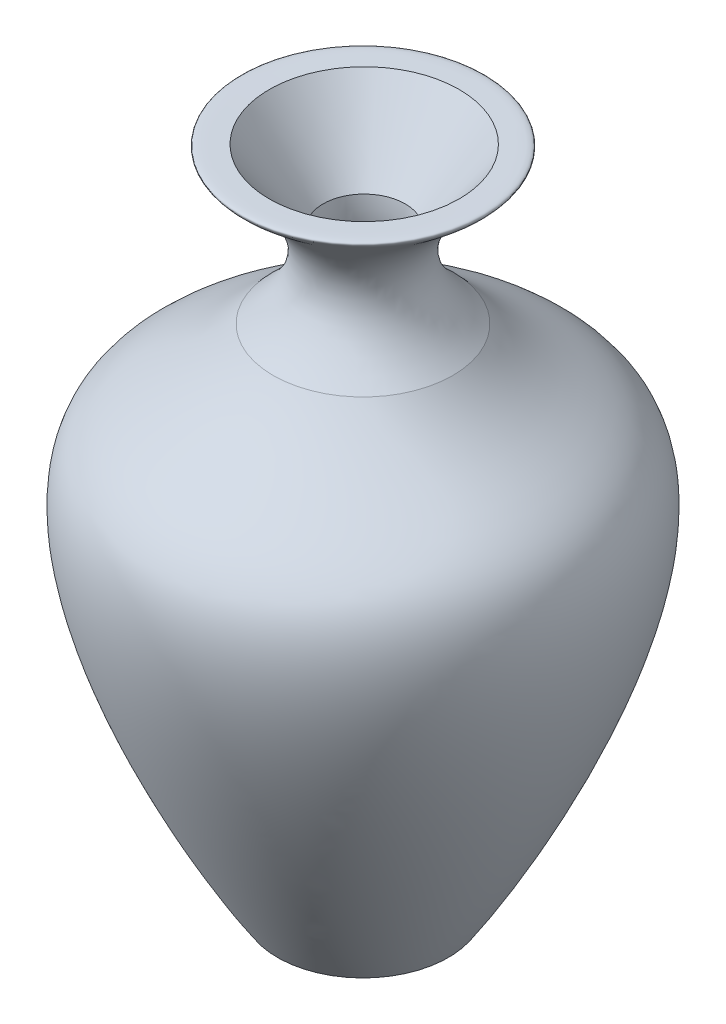
ISO-10303-21;
HEADER;
FILE_DESCRIPTION(('STEP AP214'),'2;1');
FILE_NAME('part.step','',(''),(''),'','','');
FILE_SCHEMA(('AUTOMOTIVE_DESIGN { 1 0 10303 214 1 1 1 1 }'));
ENDSEC;
DATA;
#1=APPLICATION_CONTEXT('core data for automotive mechanical design processes');
#2=APPLICATION_PROTOCOL_DEFINITION('international standard','automotive_design',2000,#1);
#3=PRODUCT_CONTEXT('',#1,'mechanical');
#4=PRODUCT('Part','Part','',(#3));
#5=PRODUCT_RELATED_PRODUCT_CATEGORY('part','',(#4));
#6=PRODUCT_DEFINITION_FORMATION('','',#4);
#7=PRODUCT_DEFINITION_CONTEXT('part definition',#1,'design');
#8=PRODUCT_DEFINITION('design','',#6,#7);
#9=PRODUCT_DEFINITION_SHAPE('','',#8);
#10=(LENGTH_UNIT() NAMED_UNIT(*) SI_UNIT(.MILLI.,.METRE.));
#11=(NAMED_UNIT(*) PLANE_ANGLE_UNIT() SI_UNIT($,.RADIAN.));
#12=(NAMED_UNIT(*) SI_UNIT($,.STERADIAN.) SOLID_ANGLE_UNIT());
#13=UNCERTAINTY_MEASURE_WITH_UNIT(LENGTH_MEASURE(1.E-05),#10,'distance_accuracy_value','');
#14=(GEOMETRIC_REPRESENTATION_CONTEXT(3) GLOBAL_UNCERTAINTY_ASSIGNED_CONTEXT((#13)) GLOBAL_UNIT_ASSIGNED_CONTEXT((#10,
#11,#12)) REPRESENTATION_CONTEXT('',''));
#15=CARTESIAN_POINT('',(0.,0.,0.));
#16=DIRECTION('',(0.,0.,1.));
#17=DIRECTION('',(1.,0.,0.));
#18=AXIS2_PLACEMENT_3D('',#15,#16,#17);
#19=CARTESIAN_POINT('',(-1.56203409294564,27.720427486685,0.));
#20=CARTESIAN_POINT('',(-5.38282688403167,31.0399201206818,0.));
#21=CARTESIAN_POINT('',(1.60950553415091,35.8701873183773,0.));
#22=CARTESIAN_POINT('',(-0.303241905816244,35.0337790173892,0.));
#23=CARTESIAN_POINT('',(-2.43505046655224,35.1344935713698,0.));
#24=B_SPLINE_CURVE_WITH_KNOTS('',3,(#19,#20,#21,#22,#23),.UNSPECIFIED.,.F.,.F.,(4,1,4),(0.,
0.485494703426431,1.),.UNSPECIFIED.);
#25=CARTESIAN_POINT('',(-5.81923390881345,35.1344935713698,0.));
#26=DIRECTION('',(0.,1.,0.));
#27=AXIS1_PLACEMENT('',#25,#26);
#28=SURFACE_OF_REVOLUTION('',#24,#27);
#29=CARTESIAN_POINT('',(-1.26087766802877,35.1223724372884,0.));
#30=CARTESIAN_POINT('',(-1.26087753263055,35.1223724373279,0.0443042542863991));
#31=CARTESIAN_POINT('',(-1.26153169142155,35.1223722686442,0.0886056860995091));
#32=CARTESIAN_POINT('',(-1.26546132133863,35.1223712553732,0.221610122033602));
#33=CARTESIAN_POINT('',(-1.2707083258953,35.1223699024367,0.310265079548945));
#34=CARTESIAN_POINT('',(-1.28644073732348,35.1223658470988,0.487170837582217));
#35=CARTESIAN_POINT('',(-1.2969304659894,35.1223631435841,0.575421243942078));
#36=CARTESIAN_POINT('',(-1.3286508122077,35.1223549720012,0.788285169210442));
#37=CARTESIAN_POINT('',(-1.35254681275785,35.1223488185444,0.912512117467511));
#38=CARTESIAN_POINT('',(-1.41071993989422,35.1223338535436,1.1585634240051));
#39=CARTESIAN_POINT('',(-1.44500210523993,35.1223250407094,1.28038658548562));
#40=CARTESIAN_POINT('',(-1.52375467443834,35.1223048226779,1.52088073057029));
#41=CARTESIAN_POINT('',(-1.56823886479373,35.1222934139728,1.63954720399103));
#42=CARTESIAN_POINT('',(-1.66707115135707,35.12226810803,1.87275069426012));
#43=CARTESIAN_POINT('',(-1.72142294769964,35.1222542098589,1.9872861426883));
#44=CARTESIAN_POINT('',(-1.8395291262891,35.1222240673695,2.21124627312288));
#45=CARTESIAN_POINT('',(-1.90327344544748,35.1222078255626,2.32067626189077));
#46=CARTESIAN_POINT('',(-2.03977948405078,35.1221731215421,2.53381657722726));
#47=CARTESIAN_POINT('',(-2.11254452375813,35.122154658511,2.63752477735675));
#48=CARTESIAN_POINT('',(-2.26649610854971,35.1221156935669,2.83836235999128));
#49=CARTESIAN_POINT('',(-2.34767610622586,35.1220951932396,2.93549676152007));
#50=CARTESIAN_POINT('',(-2.51795882830918,35.1220523116934,3.12261904623739));
#51=CARTESIAN_POINT('',(-2.6070644653195,35.1220299297833,3.21260427897817));
#52=CARTESIAN_POINT('',(-2.79252093636885,35.12198348855,3.38473155731859));
#53=CARTESIAN_POINT('',(-2.88887033171441,35.12195942956,3.46687515303981));
#54=CARTESIAN_POINT('',(-3.08818202181317,35.1219098254862,3.62278447111925));
#55=CARTESIAN_POINT('',(-3.19114674548377,35.1218842798569,3.6965470884368));
#56=CARTESIAN_POINT('',(-3.40289373137882,35.1218319326885,3.83511450206491));
#57=CARTESIAN_POINT('',(-3.51167427744369,35.1218051315203,3.89992192090286));
#58=CARTESIAN_POINT('',(-3.73434863575031,35.1217504778994,4.02016621686076));
#59=CARTESIAN_POINT('',(-3.84824432118027,35.1217226250623,4.07559962517227));
#60=CARTESIAN_POINT('',(-4.08025581408362,35.1216661153465,4.17665256488529));
#61=CARTESIAN_POINT('',(-4.19836994469058,35.1216374587883,4.22227594631855));
#62=CARTESIAN_POINT('',(-4.4380653505648,35.1215795495594,4.30342728861014));
#63=CARTESIAN_POINT('',(-4.55964788975697,35.1215502966725,4.33895151615494));
#64=CARTESIAN_POINT('',(-4.80532789436121,35.1214914453625,4.39961770569542));
#65=CARTESIAN_POINT('',(-4.92942439102247,35.1214618470742,4.4247635900372));
#66=CARTESIAN_POINT('',(-5.17933814996448,35.1214025106902,4.46452201133788));
#67=CARTESIAN_POINT('',(-5.30515603063426,35.1213727725468,4.47913065597159));
#68=CARTESIAN_POINT('',(-5.5575392124213,35.1213133980989,4.49768884368456));
#69=CARTESIAN_POINT('',(-5.68410423100856,35.1212837617617,4.50164218594701));
#70=CARTESIAN_POINT('',(-5.93713060561225,35.1212247947764,4.4988848259939));
#71=CARTESIAN_POINT('',(-6.06359190610376,35.1211954642452,4.49217018603161));
#72=CARTESIAN_POINT('',(-6.44137048209507,35.1211082701184,4.45604529001378));
#73=CARTESIAN_POINT('',(-6.69135697463565,35.1210511394012,4.41067399573289));
#74=CARTESIAN_POINT('',(-7.18002753814016,35.1209405328816,4.27862423685437));
#75=CARTESIAN_POINT('',(-7.4187115831978,35.1208870570876,4.19194567758162));
#76=CARTESIAN_POINT('',(-7.8781768633608,35.1207850667597,3.97974210330976));
#77=CARTESIAN_POINT('',(-8.09895808008324,35.120736552231,3.85421704842308));
#78=CARTESIAN_POINT('',(-8.51630196952743,35.1206456284144,3.56788419467652));
#79=CARTESIAN_POINT('',(-8.71286474697576,35.1206032191002,3.40707654839575));
#80=CARTESIAN_POINT('',(-9.07620533131539,35.120525414746,3.05474306427372));
#81=CARTESIAN_POINT('',(-9.24298315363564,35.1204900197023,2.86321724234493));
#82=CARTESIAN_POINT('',(-9.54201462087395,35.1204269456926,2.45488599967455));
#83=CARTESIAN_POINT('',(-9.67426857282372,35.120399266658,2.23808080377525));
#84=CARTESIAN_POINT('',(-9.90050062733587,35.1203521305924,1.78534386498622));
#85=CARTESIAN_POINT('',(-9.99447872566013,35.1203326735623,1.5494121199787));
#86=CARTESIAN_POINT('',(-10.1414900822778,35.1203023147281,1.06512207111319));
#87=CARTESIAN_POINT('',(-10.194523752073,35.120291412838,0.816763892170651));
#88=CARTESIAN_POINT('',(-10.2581422975856,35.1202783418358,0.314669024881669));
#89=CARTESIAN_POINT('',(-10.2687271779218,35.1202761727228,0.0609323371204537));
#90=CARTESIAN_POINT('',(-10.2471477036909,35.1202806018962,-0.444715055832771));
#91=CARTESIAN_POINT('',(-10.2149836138477,35.1202872001284,-0.696625772322444));
#92=CARTESIAN_POINT('',(-10.108819788076,35.1203090577556,-1.1914718342837));
#93=CARTESIAN_POINT('',(-10.034820049282,35.1203243171513,-1.43440717914052));
#94=CARTESIAN_POINT('',(-9.84708554516813,35.1203632427983,-1.90440648632992));
#95=CARTESIAN_POINT('',(-9.73335075111927,35.1203869090557,-2.13147043718708));
#96=CARTESIAN_POINT('',(-9.46937515098902,35.1204422301725,-2.56328121639235));
#97=CARTESIAN_POINT('',(-9.31913435130542,35.1204738850306,-2.76802804865159));
#98=CARTESIAN_POINT('',(-8.98640964563271,35.1205445816081,-3.14939398606978));
#99=CARTESIAN_POINT('',(-8.80392551407097,35.1205836233792,-3.32601289443084));
#100=CARTESIAN_POINT('',(-8.41189836843086,35.1206682869469,-3.646108200407));
#101=CARTESIAN_POINT('',(-8.2023553374855,35.1207139087476,-3.78958457736276));
#102=CARTESIAN_POINT('',(-7.76214387368225,35.1208107126769,-4.03932229300322));
#103=CARTESIAN_POINT('',(-7.53147521936628,35.1208618948638,-4.14558324150549));
#104=CARTESIAN_POINT('',(-7.05560950455655,35.1209685648094,-4.31787577664738));
#105=CARTESIAN_POINT('',(-6.81041246013058,35.1210240525633,-4.38390740777805));
#106=CARTESIAN_POINT('',(-6.31227289376171,35.1211379260026,-4.4738522003354));
#107=CARTESIAN_POINT('',(-6.05933030333105,35.1211963117137,-4.49776498922887));
#108=CARTESIAN_POINT('',(-5.67984775157347,35.1212847562143,-4.50157978921793));
#109=CARTESIAN_POINT('',(-5.55327419035652,35.1213143981744,-4.4974981838788));
#110=CARTESIAN_POINT('',(-5.3009326937113,35.1213737694905,-4.47869300915255));
#111=CARTESIAN_POINT('',(-5.17516447819358,35.1214034988103,-4.46397336792243));
#112=CARTESIAN_POINT('',(-4.92527846730702,35.1214628343712,-4.42398475430205));
#113=CARTESIAN_POINT('',(-4.80116129067157,35.1214924405635,-4.39871193594049));
#114=CARTESIAN_POINT('',(-4.55554061285282,35.1215512835136,-4.33780999224866));
#115=CARTESIAN_POINT('',(-4.4340361639703,35.1215805204037,-4.30218469246581));
#116=CARTESIAN_POINT('',(-4.19441424819941,35.1216384171602,-4.22081105736087));
#117=CARTESIAN_POINT('',(-4.0762980985955,35.1216670768007,-4.17505884362357));
#118=CARTESIAN_POINT('',(-3.84438355811532,35.1217235679769,-4.07378353684542));
#119=CARTESIAN_POINT('',(-3.73058358984512,35.1217513998142,-4.01826405600731));
#120=CARTESIAN_POINT('',(-3.5080185763155,35.1218060310618,-3.89781243098789));
#121=CARTESIAN_POINT('',(-3.39925561995268,35.1218328300429,-3.83287642699581));
#122=CARTESIAN_POINT('',(-3.18762731760227,35.1218851520096,-3.69409636110857));
#123=CARTESIAN_POINT('',(-3.08475980947048,35.1219106754626,-3.62025559626047));
#124=CARTESIAN_POINT('',(-2.88558376987274,35.1219602493213,-3.46415110075944));
#125=CARTESIAN_POINT('',(-2.78927697775437,35.1219842993362,-3.38188515081878));
#126=CARTESIAN_POINT('',(-2.60397135369882,35.1220307059349,-3.20956337256962));
#127=CARTESIAN_POINT('',(-2.51496983683792,35.1220530631405,-3.11951043144599));
#128=CARTESIAN_POINT('',(-2.34485532465581,35.1220959049049,-2.93221497426272));
#129=CARTESIAN_POINT('',(-2.26374346688504,35.1221163891936,-2.83497142499084));
#130=CARTESIAN_POINT('',(-2.11002781602581,35.1221552965687,-2.63403456736059));
#131=CARTESIAN_POINT('',(-2.03742089605686,35.1221737204127,-2.53034365100672));
#132=CARTESIAN_POINT('',(-1.90113425869163,35.122208370209,-2.31711927770567));
#133=CARTESIAN_POINT('',(-1.83746271129308,35.1222245941494,-2.20758059857717));
#134=CARTESIAN_POINT('',(-1.7196000222577,35.1222546756996,-1.98356804645505));
#135=CARTESIAN_POINT('',(-1.66540539340479,35.1222685341797,-1.86909600819519));
#136=CARTESIAN_POINT('',(-1.5667910326239,35.1222937850873,-1.63584614033358));
#137=CARTESIAN_POINT('',(-1.52238369762647,35.122305174387,-1.51706306939134));
#138=CARTESIAN_POINT('',(-1.44376214300314,35.1223253592926,-1.27621884341915));
#139=CARTESIAN_POINT('',(-1.40954412561715,35.1223341558647,-1.15415892827246));
#140=CARTESIAN_POINT('',(-1.3515784676421,35.1223490678335,-0.90782698871723));
#141=CARTESIAN_POINT('',(-1.32781083385431,35.1223551883498,-0.78355966572529));
#142=CARTESIAN_POINT('',(-1.29082692747889,35.1223647159606,-0.533515968981807));
#143=CARTESIAN_POINT('',(-1.27760594044876,35.1223681242676,-0.40774029502619));
#144=CARTESIAN_POINT('',(-1.26381931591446,35.1223716787045,-0.187875946521157));
#145=CARTESIAN_POINT('',(-1.2608779550932,35.1223724372047,-0.0939316297057552));
#146=CARTESIAN_POINT('',(-1.26087766802877,35.1223724372884,0.));
#147=B_SPLINE_CURVE_WITH_KNOTS('',3,(#29,#30,#31,#32,#33,#34,#35,#36,#37,#38,#39,#40,#41,#42,
#43,#44,#45,#46,#47,#48,#49,#50,#51,#52,#53,#54,#55,#56,#57,#58,#59,#60,#61,#62,#63,#64,#65,#66,
#67,#68,#69,#70,#71,#72,#73,#74,#75,#76,#77,#78,#79,#80,#81,#82,#83,#84,#85,#86,#87,#88,#89,#90,
#91,#92,#93,#94,#95,#96,#97,#98,#99,#100,#101,#102,#103,#104,#105,#106,#107,#108,#109,#110,#111,
#112,#113,#114,#115,#116,#117,#118,#119,#120,#121,#122,#123,#124,#125,#126,#127,#128,#129,#130,
#131,#132,#133,#134,#135,#136,#137,#138,#139,#140,#141,#142,#143,#144,#145,#146),.UNSPECIFIED.,
.T.,.F.,(4,2,2,2,2,2,2,2,2,2,2,2,2,2,2,2,2,2,2,2,2,2,2,2,2,2,2,2,2,2,2,2,2,2,2,2,2,2,2,2,2,2,2,
2,2,2,2,2,2,2,2,2,2,2,2,2,2,2,4),(0.,0.132905662664867,0.399161073844898,0.665636333284884,
1.04467462562014,1.42389710042572,1.80363508889705,2.18351576595005,2.56299236148656,
2.94260904823931,3.32193255351262,3.70139603738635,4.08078435355125,4.4603127728349,
4.83972981070314,5.21928694427244,5.59869484430177,5.97824281668574,6.35764721270749,
6.73719168431904,7.11660081018491,7.49615001541684,8.25443303843397,9.01271779942329,
9.77100333902211,10.5292855994896,11.2875674671567,12.045842590953,12.8041177987097,
13.5623853855133,14.3206528898116,15.0789156985401,15.8371785592053,16.5954419681083,
17.3537052441234,18.1119738251179,18.8702428787763,19.6285198822133,20.386796047043,
21.1450789186485,21.5246278762054,21.9040367546493,22.2835840246806,22.6629912187596,
23.0425439707637,23.4219566477263,23.8015252869761,24.1809538174249,24.560482551906,
24.9398711668818,25.3193144022081,25.6986176926473,26.078265567835,26.4577734489031,
26.8377593001121,27.2176033452988,27.5967174941342,27.9756620805486,28.2574419161945),.UNSPECIFIED.);
#148=CARTESIAN_POINT('',(-1.26087766802877,35.1223724372884,0.));
#149=VERTEX_POINT('',#148);
#150=EDGE_CURVE('E44',#149,#149,#147,.T.);
#151=ORIENTED_EDGE('',*,*,#150,.T.);
#152=EDGE_LOOP('',(#151));
#153=FACE_BOUND('',#152,.T.);
#154=CARTESIAN_POINT('',(-5.81923390881345,27.720427486685,0.));
#155=DIRECTION('',(0.,1.,0.));
#156=DIRECTION('',(-1.,0.,0.));
#157=AXIS2_PLACEMENT_3D('',#154,#155,#156);
#158=CIRCLE('',#157,4.25719981586781);
#159=CARTESIAN_POINT('',(-10.0764337246813,27.720427486685,0.));
#160=VERTEX_POINT('',#159);
#161=EDGE_CURVE('E10',#160,#160,#158,.T.);
#162=ORIENTED_EDGE('',*,*,#161,.T.);
#163=EDGE_LOOP('',(#162));
#164=FACE_BOUND('',#163,.T.);
#165=ADVANCED_FACE('F39',(#153,#164),#28,.T.);
#166=CARTESIAN_POINT('',(-1.76485332601995,3.71521370914888,0.));
#167=CARTESIAN_POINT('',(0.914400055106975,7.71569558700237,0.));
#168=CARTESIAN_POINT('',(9.15160122455947,23.4538995755936,0.));
#169=CARTESIAN_POINT('',(0.504481908151655,25.3025881254908,0.));
#170=CARTESIAN_POINT('',(-1.56203409294564,27.720427486685,0.));
#171=B_SPLINE_CURVE_WITH_KNOTS('',3,(#166,#167,#168,#169,#170),.UNSPECIFIED.,.F.,.F.,(4,1,4),
(0.,0.70796085476562,1.),.UNSPECIFIED.);
#172=CARTESIAN_POINT('',(-5.81923390881345,35.1344935713698,0.));
#173=DIRECTION('',(0.,1.,0.));
#174=AXIS1_PLACEMENT('',#172,#173);
#175=SURFACE_OF_REVOLUTION('',#171,#174);
#176=ORIENTED_EDGE('',*,*,#161,.F.);
#177=EDGE_LOOP('',(#176));
#178=FACE_BOUND('',#177,.T.);
#179=CARTESIAN_POINT('',(-5.81923390881345,3.71521370914889,0.));
#180=DIRECTION('',(0.,1.,0.));
#181=DIRECTION('',(-1.,0.,0.));
#182=AXIS2_PLACEMENT_3D('',#179,#180,#181);
#183=CIRCLE('',#182,4.05438058279351);
#184=CARTESIAN_POINT('',(-9.87361449160695,3.71521370914889,0.));
#185=VERTEX_POINT('',#184);
#186=EDGE_CURVE('E52',#185,#185,#183,.T.);
#187=ORIENTED_EDGE('',*,*,#186,.T.);
#188=EDGE_LOOP('',(#187));
#189=FACE_BOUND('',#188,.T.);
#190=ADVANCED_FACE('F68',(#178,#189),#175,.T.);
#191=CARTESIAN_POINT('',(-1.76485332601994,3.71521370914889,0.));
#192=DIRECTION('',(0.,1.,0.));
#193=DIRECTION('',(-1.,0.,0.));
#194=AXIS2_PLACEMENT_3D('',#191,#192,#193);
#195=PLANE('',#194);
#196=ORIENTED_EDGE('',*,*,#186,.F.);
#197=EDGE_LOOP('',(#196));
#198=FACE_BOUND('',#197,.T.);
#199=ADVANCED_FACE('F71',(#198),#195,.F.);
#200=CARTESIAN_POINT('',(-5.76223451194014,31.6966454719478,0.));
#201=DIRECTION('',(0.,1.,0.));
#202=DIRECTION('',(0.,0.,1.));
#203=AXIS2_PLACEMENT_3D('',#200,#201,#202);
#204=CONICAL_SURFACE('',#203,1.94847895820387,0.640426932415883);
#205=CARTESIAN_POINT('',(-5.76223451194014,31.6966454719478,0.));
#206=DIRECTION('',(0.,-1.,0.));
#207=DIRECTION('',(0.,0.,-1.));
#208=AXIS2_PLACEMENT_3D('',#205,#206,#207);
#209=CIRCLE('',#208,1.94847895820387);
#210=CARTESIAN_POINT('',(-5.76223451194014,31.6966454719478,-1.94847895820387));
#211=VERTEX_POINT('',#210);
#212=EDGE_CURVE('E103',#211,#211,#209,.T.);
#213=ORIENTED_EDGE('',*,*,#212,.T.);
#214=EDGE_LOOP('',(#213));
#215=FACE_BOUND('',#214,.T.);
#216=ORIENTED_EDGE('',*,*,#150,.F.);
#217=EDGE_LOOP('',(#216));
#218=FACE_BOUND('',#217,.T.);
#219=ADVANCED_FACE('F74',(#215,#218),#204,.F.);
#220=CARTESIAN_POINT('',(-2.32252201907501,27.720427486685,0.));
#221=CARTESIAN_POINT('',(-4.192225418984,28.9695763063603,0.));
#222=CARTESIAN_POINT('',(-3.81375555373627,31.6966454719478,0.));
#223=B_SPLINE_CURVE_WITH_KNOTS('',2,(#220,#221,#222),.UNSPECIFIED.,.F.,.F.,(3,3),(0.,1.),.UNSPECIFIED.);
#224=CARTESIAN_POINT('',(-5.76223451194014,4.78978540951791,0.));
#225=DIRECTION('',(0.,-1.,0.));
#226=AXIS1_PLACEMENT('',#224,#225);
#227=SURFACE_OF_REVOLUTION('',#223,#226);
#228=ORIENTED_EDGE('',*,*,#212,.F.);
#229=EDGE_LOOP('',(#228));
#230=FACE_BOUND('',#229,.T.);
#231=CARTESIAN_POINT('',(-5.76223451194014,27.720427486685,0.));
#232=DIRECTION('',(0.,-1.,0.));
#233=DIRECTION('',(0.,0.,-1.));
#234=AXIS2_PLACEMENT_3D('',#231,#232,#233);
#235=CIRCLE('',#234,3.43971249286514);
#236=CARTESIAN_POINT('',(-5.76223451194014,27.720427486685,-3.43971249286514));
#237=VERTEX_POINT('',#236);
#238=EDGE_CURVE('E101',#237,#237,#235,.T.);
#239=ORIENTED_EDGE('',*,*,#238,.T.);
#240=EDGE_LOOP('',(#239));
#241=FACE_BOUND('',#240,.T.);
#242=ADVANCED_FACE('F79',(#230,#241),#227,.T.);
#243=CARTESIAN_POINT('',(-2.93124179886138,4.78978540951791,0.));
#244=CARTESIAN_POINT('',(-0.75363710048524,8.77821511654387,0.));
#245=CARTESIAN_POINT('',(6.440819142608,19.7399276136153,0.));
#246=CARTESIAN_POINT('',(-0.735940167770308,26.4592907266743,0.));
#247=CARTESIAN_POINT('',(-2.32252201907501,27.720427486685,0.));
#248=B_SPLINE_CURVE_WITH_KNOTS('',3,(#243,#244,#245,#246,#247),.UNSPECIFIED.,.F.,.F.,(4,1,4),
(0.,0.741714706346778,1.),.UNSPECIFIED.);
#249=CARTESIAN_POINT('',(-5.76223451194014,4.78978540951791,0.));
#250=DIRECTION('',(0.,-1.,0.));
#251=AXIS1_PLACEMENT('',#249,#250);
#252=SURFACE_OF_REVOLUTION('',#248,#251);
#253=ORIENTED_EDGE('',*,*,#238,.F.);
#254=EDGE_LOOP('',(#253));
#255=FACE_BOUND('',#254,.T.);
#256=CARTESIAN_POINT('',(-5.76223451194014,4.78978540951791,0.));
#257=DIRECTION('',(0.,-1.,0.));
#258=DIRECTION('',(0.,0.,-1.));
#259=AXIS2_PLACEMENT_3D('',#256,#257,#258);
#260=CIRCLE('',#259,2.83099271307876);
#261=CARTESIAN_POINT('',(-5.76223451194014,4.78978540951791,-2.83099271307876));
#262=VERTEX_POINT('',#261);
#263=EDGE_CURVE('E95',#262,#262,#260,.T.);
#264=ORIENTED_EDGE('',*,*,#263,.T.);
#265=EDGE_LOOP('',(#264));
#266=FACE_BOUND('',#265,.T.);
#267=ADVANCED_FACE('F84',(#255,#266),#252,.T.);
#268=CARTESIAN_POINT('',(-2.93124179886138,4.78978540951791,0.));
#269=DIRECTION('',(0.,-1.,0.));
#270=DIRECTION('',(0.,0.,-1.));
#271=AXIS2_PLACEMENT_3D('',#268,#269,#270);
#272=PLANE('',#271);
#273=ORIENTED_EDGE('',*,*,#263,.F.);
#274=EDGE_LOOP('',(#273));
#275=FACE_BOUND('',#274,.T.);
#276=ADVANCED_FACE('F135',(#275),#272,.F.);
#277=CLOSED_SHELL('',(#165,#190,#199,#219,#242,#267,#276));
#278=MANIFOLD_SOLID_BREP('B2',#277);
#279=ADVANCED_BREP_SHAPE_REPRESENTATION('',(#18,#278),#14);
#280=SHAPE_DEFINITION_REPRESENTATION(#9,#279);
ENDSEC;
END-ISO-10303-21;
